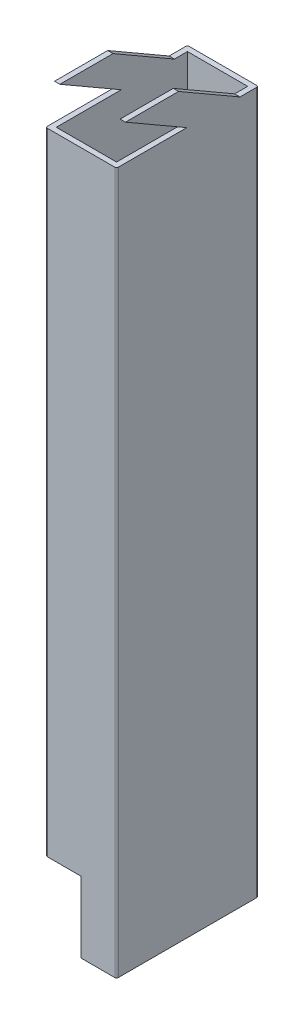
ISO-10303-21;
HEADER;
FILE_DESCRIPTION(('STEP AP214'),'2;1');
FILE_NAME('part.step','',(''),(''),'','','');
FILE_SCHEMA(('AUTOMOTIVE_DESIGN { 1 0 10303 214 1 1 1 1 }'));
ENDSEC;
DATA;
#1=APPLICATION_CONTEXT('core data for automotive mechanical design processes');
#2=APPLICATION_PROTOCOL_DEFINITION('international standard','automotive_design',2000,#1);
#3=PRODUCT_CONTEXT('',#1,'mechanical');
#4=PRODUCT('Part','Part','',(#3));
#5=PRODUCT_RELATED_PRODUCT_CATEGORY('part','',(#4));
#6=PRODUCT_DEFINITION_FORMATION('','',#4);
#7=PRODUCT_DEFINITION_CONTEXT('part definition',#1,'design');
#8=PRODUCT_DEFINITION('design','',#6,#7);
#9=PRODUCT_DEFINITION_SHAPE('','',#8);
#10=(LENGTH_UNIT() NAMED_UNIT(*) SI_UNIT(.MILLI.,.METRE.));
#11=(NAMED_UNIT(*) PLANE_ANGLE_UNIT() SI_UNIT($,.RADIAN.));
#12=(NAMED_UNIT(*) SI_UNIT($,.STERADIAN.) SOLID_ANGLE_UNIT());
#13=UNCERTAINTY_MEASURE_WITH_UNIT(LENGTH_MEASURE(1.E-05),#10,'distance_accuracy_value','');
#14=(GEOMETRIC_REPRESENTATION_CONTEXT(3) GLOBAL_UNCERTAINTY_ASSIGNED_CONTEXT((#13)) GLOBAL_UNIT_ASSIGNED_CONTEXT((#10,
#11,#12)) REPRESENTATION_CONTEXT('',''));
#15=CARTESIAN_POINT('',(0.,0.,0.));
#16=DIRECTION('',(0.,0.,1.));
#17=DIRECTION('',(1.,0.,0.));
#18=AXIS2_PLACEMENT_3D('',#15,#16,#17);
#19=CARTESIAN_POINT('',(19.5,208.,-0.5));
#20=DIRECTION('',(0.,1.,0.));
#21=DIRECTION('',(0.,0.,1.));
#22=AXIS2_PLACEMENT_3D('',#19,#20,#21);
#23=PLANE('',#22);
#24=DIRECTION('',(0.,0.,-1.));
#25=VECTOR('',#24,1.);
#26=CARTESIAN_POINT('',(20.,208.,-0.5));
#27=LINE('',#26,#25);
#28=CARTESIAN_POINT('',(20.,208.,-2.5));
#29=VERTEX_POINT('',#28);
#30=CARTESIAN_POINT('',(20.,208.,-17.5));
#31=VERTEX_POINT('',#30);
#32=EDGE_CURVE('E233',#29,#31,#27,.T.);
#33=ORIENTED_EDGE('',*,*,#32,.T.);
#34=DIRECTION('',(-1.,0.,0.));
#35=VECTOR('',#34,1.);
#36=CARTESIAN_POINT('',(40.,208.,-17.5));
#37=LINE('',#36,#35);
#38=CARTESIAN_POINT('',(18.5,208.,-17.5));
#39=VERTEX_POINT('',#38);
#40=EDGE_CURVE('E223',#31,#39,#37,.T.);
#41=ORIENTED_EDGE('',*,*,#40,.T.);
#42=DIRECTION('',(0.,0.,-1.));
#43=VECTOR('',#42,1.);
#44=CARTESIAN_POINT('',(18.5,208.,-1.5));
#45=LINE('',#44,#43);
#46=CARTESIAN_POINT('',(18.5,208.,-2.5));
#47=VERTEX_POINT('',#46);
#48=EDGE_CURVE('E395',#47,#39,#45,.T.);
#49=ORIENTED_EDGE('',*,*,#48,.F.);
#50=DIRECTION('',(-1.,0.,0.));
#51=VECTOR('',#50,1.);
#52=CARTESIAN_POINT('',(40.,208.,-2.5));
#53=LINE('',#52,#51);
#54=EDGE_CURVE('E55',#29,#47,#53,.T.);
#55=ORIENTED_EDGE('',*,*,#54,.F.);
#56=EDGE_LOOP('',(#33,#41,#49,#55));
#57=FACE_BOUND('',#56,.T.);
#58=ADVANCED_FACE('F39',(#57),#23,.T.);
#59=DIRECTION('',(0.,0.,1.));
#60=VECTOR('',#59,1.);
#61=CARTESIAN_POINT('',(1.5,208.,-1.5));
#62=LINE('',#61,#60);
#63=CARTESIAN_POINT('',(1.5,208.,-17.5));
#64=VERTEX_POINT('',#63);
#65=CARTESIAN_POINT('',(1.5,208.,-2.5));
#66=VERTEX_POINT('',#65);
#67=EDGE_CURVE('E221',#64,#66,#62,.T.);
#68=ORIENTED_EDGE('',*,*,#67,.F.);
#69=CARTESIAN_POINT('',(0.,208.,-17.5));
#70=VERTEX_POINT('',#69);
#71=EDGE_CURVE('E204',#64,#70,#37,.T.);
#72=ORIENTED_EDGE('',*,*,#71,.T.);
#73=DIRECTION('',(0.,0.,1.));
#74=VECTOR('',#73,1.);
#75=CARTESIAN_POINT('',(0.,208.,-0.500000000000004));
#76=LINE('',#75,#74);
#77=CARTESIAN_POINT('',(0.,208.,-2.5));
#78=VERTEX_POINT('',#77);
#79=EDGE_CURVE('E219',#70,#78,#76,.T.);
#80=ORIENTED_EDGE('',*,*,#79,.T.);
#81=EDGE_CURVE('E489',#66,#78,#53,.T.);
#82=ORIENTED_EDGE('',*,*,#81,.F.);
#83=EDGE_LOOP('',(#68,#72,#80,#82));
#84=FACE_BOUND('',#83,.T.);
#85=ADVANCED_FACE('F217',(#84),#23,.T.);
#86=CARTESIAN_POINT('',(19.5,208.,-0.5));
#87=DIRECTION('',(0.,-1.,0.));
#88=DIRECTION('',(0.,0.,-1.));
#89=AXIS2_PLACEMENT_3D('',#86,#87,#88);
#90=CYLINDRICAL_SURFACE('',#89,0.5);
#91=CARTESIAN_POINT('',(19.5,198.,-0.5));
#92=DIRECTION('',(0.,1.,0.));
#93=DIRECTION('',(0.,0.,1.));
#94=AXIS2_PLACEMENT_3D('',#91,#92,#93);
#95=CIRCLE('',#94,0.5);
#96=CARTESIAN_POINT('',(19.5,198.,0.));
#97=VERTEX_POINT('',#96);
#98=CARTESIAN_POINT('',(20.,198.,-0.5));
#99=VERTEX_POINT('',#98);
#100=EDGE_CURVE('E336',#97,#99,#95,.T.);
#101=ORIENTED_EDGE('',*,*,#100,.F.);
#102=DIRECTION('',(0.,-1.,0.));
#103=VECTOR('',#102,1.);
#104=CARTESIAN_POINT('',(19.5,208.,0.));
#105=LINE('',#104,#103);
#106=CARTESIAN_POINT('',(19.5,0.,0.));
#107=VERTEX_POINT('',#106);
#108=EDGE_CURVE('E232',#97,#107,#105,.T.);
#109=ORIENTED_EDGE('',*,*,#108,.T.);
#110=CARTESIAN_POINT('',(19.5,0.,-0.5));
#111=DIRECTION('',(0.,1.,0.));
#112=DIRECTION('',(0.,0.,1.));
#113=AXIS2_PLACEMENT_3D('',#110,#111,#112);
#114=CIRCLE('',#113,0.5);
#115=CARTESIAN_POINT('',(20.,0.,-0.5));
#116=VERTEX_POINT('',#115);
#117=EDGE_CURVE('E244',#107,#116,#114,.T.);
#118=ORIENTED_EDGE('',*,*,#117,.T.);
#119=DIRECTION('',(0.,-1.,0.));
#120=VECTOR('',#119,1.);
#121=CARTESIAN_POINT('',(20.,208.,-0.5));
#122=LINE('',#121,#120);
#123=EDGE_CURVE('E281',#99,#116,#122,.T.);
#124=ORIENTED_EDGE('',*,*,#123,.F.);
#125=EDGE_LOOP('',(#101,#109,#118,#124));
#126=FACE_BOUND('',#125,.T.);
#127=ADVANCED_FACE('F41',(#126),#90,.T.);
#128=CARTESIAN_POINT('',(20.,208.,-0.5));
#129=DIRECTION('',(-1.,0.,0.));
#130=DIRECTION('',(0.,0.,1.));
#131=AXIS2_PLACEMENT_3D('',#128,#129,#130);
#132=PLANE('',#131);
#133=DIRECTION('',(0.,-0.500000000000001,-0.866025403784438));
#134=VECTOR('',#133,1.);
#135=CARTESIAN_POINT('',(20.,215.361215932168,-4.75000000000001));
#136=LINE('',#135,#134);
#137=CARTESIAN_POINT('',(20.,198.,-34.8205080756887));
#138=VERTEX_POINT('',#137);
#139=EDGE_CURVE('E342',#31,#138,#136,.T.);
#140=ORIENTED_EDGE('',*,*,#139,.F.);
#141=ORIENTED_EDGE('',*,*,#32,.F.);
#142=DIRECTION('',(0.,0.500000000000002,0.866025403784438));
#143=VECTOR('',#142,1.);
#144=CARTESIAN_POINT('',(20.,208.866025403784,-1.));
#145=LINE('',#144,#143);
#146=CARTESIAN_POINT('',(20.,198.,-19.8205080756887));
#147=VERTEX_POINT('',#146);
#148=EDGE_CURVE('E321',#147,#29,#145,.T.);
#149=ORIENTED_EDGE('',*,*,#148,.F.);
#150=DIRECTION('',(0.,0.,-1.));
#151=VECTOR('',#150,1.);
#152=CARTESIAN_POINT('',(20.,198.,-0.5));
#153=LINE('',#152,#151);
#154=EDGE_CURVE('E333',#99,#147,#153,.T.);
#155=ORIENTED_EDGE('',*,*,#154,.F.);
#156=ORIENTED_EDGE('',*,*,#123,.T.);
#157=DIRECTION('',(0.,0.,-1.));
#158=VECTOR('',#157,1.);
#159=CARTESIAN_POINT('',(20.,0.,-0.5));
#160=LINE('',#159,#158);
#161=CARTESIAN_POINT('',(20.,0.,-39.5));
#162=VERTEX_POINT('',#161);
#163=EDGE_CURVE('E248',#116,#162,#160,.T.);
#164=ORIENTED_EDGE('',*,*,#163,.T.);
#165=DIRECTION('',(0.,-1.,0.));
#166=VECTOR('',#165,1.);
#167=CARTESIAN_POINT('',(20.,208.,-39.5));
#168=LINE('',#167,#166);
#169=CARTESIAN_POINT('',(20.,198.,-39.5));
#170=VERTEX_POINT('',#169);
#171=EDGE_CURVE('E278',#170,#162,#168,.T.);
#172=ORIENTED_EDGE('',*,*,#171,.F.);
#173=DIRECTION('',(0.,0.,-1.));
#174=VECTOR('',#173,1.);
#175=CARTESIAN_POINT('',(20.,198.,-0.5));
#176=LINE('',#175,#174);
#177=EDGE_CURVE('E483',#138,#170,#176,.T.);
#178=ORIENTED_EDGE('',*,*,#177,.F.);
#179=EDGE_LOOP('',(#140,#141,#149,#155,#156,#164,#172,#178));
#180=FACE_BOUND('',#179,.T.);
#181=ADVANCED_FACE('F522',(#180),#132,.F.);
#182=CARTESIAN_POINT('',(19.5,208.,-39.5));
#183=DIRECTION('',(0.,-1.,0.));
#184=DIRECTION('',(0.,0.,-1.));
#185=AXIS2_PLACEMENT_3D('',#182,#183,#184);
#186=CYLINDRICAL_SURFACE('',#185,0.5);
#187=CARTESIAN_POINT('',(19.5,198.,-39.5));
#188=DIRECTION('',(0.,1.,0.));
#189=DIRECTION('',(0.,0.,1.));
#190=AXIS2_PLACEMENT_3D('',#187,#188,#189);
#191=CIRCLE('',#190,0.5);
#192=CARTESIAN_POINT('',(19.5,198.,-40.));
#193=VERTEX_POINT('',#192);
#194=EDGE_CURVE('E475',#170,#193,#191,.T.);
#195=ORIENTED_EDGE('',*,*,#194,.F.);
#196=ORIENTED_EDGE('',*,*,#171,.T.);
#197=CARTESIAN_POINT('',(19.5,0.,-39.5));
#198=DIRECTION('',(0.,1.,0.));
#199=DIRECTION('',(0.,0.,-1.));
#200=AXIS2_PLACEMENT_3D('',#197,#198,#199);
#201=CIRCLE('',#200,0.5);
#202=CARTESIAN_POINT('',(19.5,0.,-40.));
#203=VERTEX_POINT('',#202);
#204=EDGE_CURVE('E253',#162,#203,#201,.T.);
#205=ORIENTED_EDGE('',*,*,#204,.T.);
#206=DIRECTION('',(0.,-1.,0.));
#207=VECTOR('',#206,1.);
#208=CARTESIAN_POINT('',(19.5,208.,-40.));
#209=LINE('',#208,#207);
#210=EDGE_CURVE('E275',#193,#203,#209,.T.);
#211=ORIENTED_EDGE('',*,*,#210,.F.);
#212=EDGE_LOOP('',(#195,#196,#205,#211));
#213=FACE_BOUND('',#212,.T.);
#214=ADVANCED_FACE('F529',(#213),#186,.T.);
#215=CARTESIAN_POINT('',(0.500000000000004,208.,-40.));
#216=DIRECTION('',(0.,0.,1.));
#217=DIRECTION('',(1.,0.,0.));
#218=AXIS2_PLACEMENT_3D('',#215,#216,#217);
#219=PLANE('',#218);
#220=DIRECTION('',(-1.,0.,0.));
#221=VECTOR('',#220,1.);
#222=CARTESIAN_POINT('',(40.,198.,-40.));
#223=LINE('',#222,#221);
#224=CARTESIAN_POINT('',(0.5,198.,-40.));
#225=VERTEX_POINT('',#224);
#226=EDGE_CURVE('E508',#193,#225,#223,.T.);
#227=ORIENTED_EDGE('',*,*,#226,.F.);
#228=ORIENTED_EDGE('',*,*,#210,.T.);
#229=DIRECTION('',(-1.,0.,0.));
#230=VECTOR('',#229,1.);
#231=CARTESIAN_POINT('',(0.500000000000004,0.,-40.));
#232=LINE('',#231,#230);
#233=CARTESIAN_POINT('',(10.,0.,-40.));
#234=VERTEX_POINT('',#233);
#235=EDGE_CURVE('E257',#203,#234,#232,.T.);
#236=ORIENTED_EDGE('',*,*,#235,.T.);
#237=DIRECTION('',(0.,1.,0.));
#238=VECTOR('',#237,1.);
#239=CARTESIAN_POINT('',(10.,0.,-40.));
#240=LINE('',#239,#238);
#241=CARTESIAN_POINT('',(10.,20.,-40.));
#242=VERTEX_POINT('',#241);
#243=EDGE_CURVE('E346',#234,#242,#240,.T.);
#244=ORIENTED_EDGE('',*,*,#243,.T.);
#245=DIRECTION('',(-1.,0.,0.));
#246=VECTOR('',#245,1.);
#247=CARTESIAN_POINT('',(10.,20.,-40.));
#248=LINE('',#247,#246);
#249=CARTESIAN_POINT('',(0.5,20.,-40.));
#250=VERTEX_POINT('',#249);
#251=EDGE_CURVE('E350',#242,#250,#248,.T.);
#252=ORIENTED_EDGE('',*,*,#251,.T.);
#253=DIRECTION('',(0.,-1.,0.));
#254=VECTOR('',#253,1.);
#255=CARTESIAN_POINT('',(0.5,208.,-40.));
#256=LINE('',#255,#254);
#257=EDGE_CURVE('E272',#225,#250,#256,.T.);
#258=ORIENTED_EDGE('',*,*,#257,.F.);
#259=EDGE_LOOP('',(#227,#228,#236,#244,#252,#258));
#260=FACE_BOUND('',#259,.T.);
#261=ADVANCED_FACE('F459',(#260),#219,.F.);
#262=CARTESIAN_POINT('',(0.5,208.,-39.5));
#263=DIRECTION('',(0.,-1.,0.));
#264=DIRECTION('',(0.,0.,-1.));
#265=AXIS2_PLACEMENT_3D('',#262,#263,#264);
#266=CYLINDRICAL_SURFACE('',#265,0.5);
#267=CARTESIAN_POINT('',(0.5,198.,-39.5));
#268=DIRECTION('',(0.,1.,0.));
#269=DIRECTION('',(0.,0.,1.));
#270=AXIS2_PLACEMENT_3D('',#267,#268,#269);
#271=CIRCLE('',#270,0.5);
#272=CARTESIAN_POINT('',(0.,198.,-39.5));
#273=VERTEX_POINT('',#272);
#274=EDGE_CURVE('E455',#225,#273,#271,.T.);
#275=ORIENTED_EDGE('',*,*,#274,.F.);
#276=ORIENTED_EDGE('',*,*,#257,.T.);
#277=CARTESIAN_POINT('',(0.5,20.,-39.5));
#278=DIRECTION('',(0.,1.,0.));
#279=DIRECTION('',(-1.,0.,0.));
#280=AXIS2_PLACEMENT_3D('',#277,#278,#279);
#281=CIRCLE('',#280,0.5);
#282=CARTESIAN_POINT('',(0.,20.,-39.5));
#283=VERTEX_POINT('',#282);
#284=EDGE_CURVE('E388',#250,#283,#281,.T.);
#285=ORIENTED_EDGE('',*,*,#284,.T.);
#286=DIRECTION('',(0.,-1.,0.));
#287=VECTOR('',#286,1.);
#288=CARTESIAN_POINT('',(0.,208.,-39.5));
#289=LINE('',#288,#287);
#290=EDGE_CURVE('E269',#273,#283,#289,.T.);
#291=ORIENTED_EDGE('',*,*,#290,.F.);
#292=EDGE_LOOP('',(#275,#276,#285,#291));
#293=FACE_BOUND('',#292,.T.);
#294=ADVANCED_FACE('F454',(#293),#266,.T.);
#295=CARTESIAN_POINT('',(0.,208.,-0.500000000000004));
#296=DIRECTION('',(1.,0.,0.));
#297=DIRECTION('',(0.,0.,-1.));
#298=AXIS2_PLACEMENT_3D('',#295,#296,#297);
#299=PLANE('',#298);
#300=DIRECTION('',(0.,-0.500000000000001,-0.866025403784438));
#301=VECTOR('',#300,1.);
#302=CARTESIAN_POINT('',(0.,208.,-17.5));
#303=LINE('',#302,#301);
#304=CARTESIAN_POINT('',(0.,198.,-34.8205080756887));
#305=VERTEX_POINT('',#304);
#306=EDGE_CURVE('E201',#70,#305,#303,.T.);
#307=ORIENTED_EDGE('',*,*,#306,.T.);
#308=DIRECTION('',(0.,0.,-1.));
#309=VECTOR('',#308,1.);
#310=CARTESIAN_POINT('',(0.,198.,-34.8205080756887));
#311=LINE('',#310,#309);
#312=EDGE_CURVE('E212',#305,#273,#311,.T.);
#313=ORIENTED_EDGE('',*,*,#312,.T.);
#314=ORIENTED_EDGE('',*,*,#290,.T.);
#315=DIRECTION('',(0.,0.,1.));
#316=VECTOR('',#315,1.);
#317=CARTESIAN_POINT('',(0.,20.,-40.));
#318=LINE('',#317,#316);
#319=CARTESIAN_POINT('',(0.,20.,-0.5));
#320=VERTEX_POINT('',#319);
#321=EDGE_CURVE('E362',#283,#320,#318,.T.);
#322=ORIENTED_EDGE('',*,*,#321,.T.);
#323=DIRECTION('',(0.,-1.,0.));
#324=VECTOR('',#323,1.);
#325=CARTESIAN_POINT('',(0.,208.,-0.500000000000003));
#326=LINE('',#325,#324);
#327=CARTESIAN_POINT('',(0.,198.,-0.5));
#328=VERTEX_POINT('',#327);
#329=EDGE_CURVE('E266',#328,#320,#326,.T.);
#330=ORIENTED_EDGE('',*,*,#329,.F.);
#331=DIRECTION('',(0.,0.,-1.));
#332=VECTOR('',#331,1.);
#333=CARTESIAN_POINT('',(0.,198.,0.));
#334=LINE('',#333,#332);
#335=CARTESIAN_POINT('',(0.,198.,-19.8205080756887));
#336=VERTEX_POINT('',#335);
#337=EDGE_CURVE('E495',#328,#336,#334,.T.);
#338=ORIENTED_EDGE('',*,*,#337,.T.);
#339=DIRECTION('',(0.,0.500000000000002,0.866025403784438));
#340=VECTOR('',#339,1.);
#341=CARTESIAN_POINT('',(0.,198.,-19.8205080756887));
#342=LINE('',#341,#340);
#343=EDGE_CURVE('E230',#336,#78,#342,.T.);
#344=ORIENTED_EDGE('',*,*,#343,.T.);
#345=ORIENTED_EDGE('',*,*,#79,.F.);
#346=EDGE_LOOP('',(#307,#313,#314,#322,#330,#338,#344,#345));
#347=FACE_BOUND('',#346,.T.);
#348=ADVANCED_FACE('F227',(#347),#299,.F.);
#349=CARTESIAN_POINT('',(0.5,208.,-0.5));
#350=DIRECTION('',(0.,-1.,0.));
#351=DIRECTION('',(0.,0.,-1.));
#352=AXIS2_PLACEMENT_3D('',#349,#350,#351);
#353=CYLINDRICAL_SURFACE('',#352,0.5);
#354=CARTESIAN_POINT('',(0.5,198.,-0.5));
#355=DIRECTION('',(0.,1.,0.));
#356=DIRECTION('',(0.,0.,1.));
#357=AXIS2_PLACEMENT_3D('',#354,#355,#356);
#358=CIRCLE('',#357,0.5);
#359=CARTESIAN_POINT('',(0.5,198.,0.));
#360=VERTEX_POINT('',#359);
#361=EDGE_CURVE('E325',#328,#360,#358,.T.);
#362=ORIENTED_EDGE('',*,*,#361,.F.);
#363=ORIENTED_EDGE('',*,*,#329,.T.);
#364=CARTESIAN_POINT('',(0.5,20.,-0.5));
#365=DIRECTION('',(0.,1.,0.));
#366=DIRECTION('',(-1.,0.,0.));
#367=AXIS2_PLACEMENT_3D('',#364,#365,#366);
#368=CIRCLE('',#367,0.5);
#369=CARTESIAN_POINT('',(0.500000000000004,20.,0.));
#370=VERTEX_POINT('',#369);
#371=EDGE_CURVE('E384',#320,#370,#368,.T.);
#372=ORIENTED_EDGE('',*,*,#371,.T.);
#373=DIRECTION('',(0.,-1.,0.));
#374=VECTOR('',#373,1.);
#375=CARTESIAN_POINT('',(0.500000000000004,208.,0.));
#376=LINE('',#375,#374);
#377=EDGE_CURVE('E237',#360,#370,#376,.T.);
#378=ORIENTED_EDGE('',*,*,#377,.F.);
#379=EDGE_LOOP('',(#362,#363,#372,#378));
#380=FACE_BOUND('',#379,.T.);
#381=ADVANCED_FACE('F447',(#380),#353,.T.);
#382=CARTESIAN_POINT('',(0.500000000000004,208.,0.));
#383=DIRECTION('',(0.,0.,-1.));
#384=DIRECTION('',(-1.,0.,0.));
#385=AXIS2_PLACEMENT_3D('',#382,#383,#384);
#386=PLANE('',#385);
#387=DIRECTION('',(-1.,0.,0.));
#388=VECTOR('',#387,1.);
#389=CARTESIAN_POINT('',(40.,198.,0.));
#390=LINE('',#389,#388);
#391=EDGE_CURVE('E444',#97,#360,#390,.T.);
#392=ORIENTED_EDGE('',*,*,#391,.T.);
#393=ORIENTED_EDGE('',*,*,#377,.T.);
#394=DIRECTION('',(-1.,0.,0.));
#395=VECTOR('',#394,1.);
#396=CARTESIAN_POINT('',(10.,20.,0.));
#397=LINE('',#396,#395);
#398=CARTESIAN_POINT('',(10.,20.,0.));
#399=VERTEX_POINT('',#398);
#400=EDGE_CURVE('E351',#399,#370,#397,.T.);
#401=ORIENTED_EDGE('',*,*,#400,.F.);
#402=DIRECTION('',(0.,1.,0.));
#403=VECTOR('',#402,1.);
#404=CARTESIAN_POINT('',(10.,0.,0.));
#405=LINE('',#404,#403);
#406=CARTESIAN_POINT('',(10.,0.,0.));
#407=VERTEX_POINT('',#406);
#408=EDGE_CURVE('E345',#407,#399,#405,.T.);
#409=ORIENTED_EDGE('',*,*,#408,.F.);
#410=DIRECTION('',(1.,0.,0.));
#411=VECTOR('',#410,1.);
#412=CARTESIAN_POINT('',(0.500000000000004,0.,0.));
#413=LINE('',#412,#411);
#414=EDGE_CURVE('E240',#407,#107,#413,.T.);
#415=ORIENTED_EDGE('',*,*,#414,.T.);
#416=ORIENTED_EDGE('',*,*,#108,.F.);
#417=EDGE_LOOP('',(#392,#393,#401,#409,#415,#416));
#418=FACE_BOUND('',#417,.T.);
#419=ADVANCED_FACE('F441',(#418),#386,.F.);
#420=CARTESIAN_POINT('',(1.5,208.,-1.5));
#421=DIRECTION('',(1.,0.,0.));
#422=DIRECTION('',(0.,0.,-1.));
#423=AXIS2_PLACEMENT_3D('',#420,#421,#422);
#424=PLANE('',#423);
#425=DIRECTION('',(0.,0.,1.));
#426=VECTOR('',#425,1.);
#427=CARTESIAN_POINT('',(1.5,198.,-1.5));
#428=LINE('',#427,#426);
#429=CARTESIAN_POINT('',(1.5,198.,-38.5));
#430=VERTEX_POINT('',#429);
#431=CARTESIAN_POINT('',(1.5,198.,-34.8205080756887));
#432=VERTEX_POINT('',#431);
#433=EDGE_CURVE('E63',#430,#432,#428,.T.);
#434=ORIENTED_EDGE('',*,*,#433,.T.);
#435=DIRECTION('',(0.,0.500000000000001,0.866025403784438));
#436=VECTOR('',#435,1.);
#437=CARTESIAN_POINT('',(1.5,214.928203230275,-5.50000000000001));
#438=LINE('',#437,#436);
#439=EDGE_CURVE('E339',#432,#64,#438,.T.);
#440=ORIENTED_EDGE('',*,*,#439,.T.);
#441=ORIENTED_EDGE('',*,*,#67,.T.);
#442=DIRECTION('',(0.,-0.500000000000002,-0.866025403784438));
#443=VECTOR('',#442,1.);
#444=CARTESIAN_POINT('',(1.5,208.433012701892,-1.75));
#445=LINE('',#444,#443);
#446=CARTESIAN_POINT('',(1.5,198.,-19.8205080756887));
#447=VERTEX_POINT('',#446);
#448=EDGE_CURVE('E327',#66,#447,#445,.T.);
#449=ORIENTED_EDGE('',*,*,#448,.T.);
#450=DIRECTION('',(0.,0.,1.));
#451=VECTOR('',#450,1.);
#452=CARTESIAN_POINT('',(1.5,198.,-1.5));
#453=LINE('',#452,#451);
#454=CARTESIAN_POINT('',(1.5,198.,-1.5));
#455=VERTEX_POINT('',#454);
#456=EDGE_CURVE('E320',#447,#455,#453,.T.);
#457=ORIENTED_EDGE('',*,*,#456,.T.);
#458=DIRECTION('',(0.,-1.,0.));
#459=VECTOR('',#458,1.);
#460=CARTESIAN_POINT('',(1.5,208.,-1.5));
#461=LINE('',#460,#459);
#462=CARTESIAN_POINT('',(1.5,20.,-1.5));
#463=VERTEX_POINT('',#462);
#464=EDGE_CURVE('E249',#455,#463,#461,.T.);
#465=ORIENTED_EDGE('',*,*,#464,.T.);
#466=DIRECTION('',(0.,0.,1.));
#467=VECTOR('',#466,1.);
#468=CARTESIAN_POINT('',(1.5,20.,-1.5));
#469=LINE('',#468,#467);
#470=CARTESIAN_POINT('',(1.5,20.,-38.5));
#471=VERTEX_POINT('',#470);
#472=EDGE_CURVE('E377',#471,#463,#469,.T.);
#473=ORIENTED_EDGE('',*,*,#472,.F.);
#474=DIRECTION('',(0.,-1.,0.));
#475=VECTOR('',#474,1.);
#476=CARTESIAN_POINT('',(1.5,208.,-38.5));
#477=LINE('',#476,#475);
#478=EDGE_CURVE('E399',#430,#471,#477,.T.);
#479=ORIENTED_EDGE('',*,*,#478,.F.);
#480=EDGE_LOOP('',(#434,#440,#441,#449,#457,#465,#473,#479));
#481=FACE_BOUND('',#480,.T.);
#482=ADVANCED_FACE('F418',(#481),#424,.T.);
#483=CARTESIAN_POINT('',(1.5,208.,-1.5));
#484=DIRECTION('',(0.,0.,-1.));
#485=DIRECTION('',(-1.,0.,0.));
#486=AXIS2_PLACEMENT_3D('',#483,#484,#485);
#487=PLANE('',#486);
#488=ORIENTED_EDGE('',*,*,#464,.F.);
#489=DIRECTION('',(1.,0.,0.));
#490=VECTOR('',#489,1.);
#491=CARTESIAN_POINT('',(1.5,198.,-1.5));
#492=LINE('',#491,#490);
#493=CARTESIAN_POINT('',(18.5,198.,-1.5));
#494=VERTEX_POINT('',#493);
#495=EDGE_CURVE('E309',#455,#494,#492,.T.);
#496=ORIENTED_EDGE('',*,*,#495,.T.);
#497=DIRECTION('',(0.,-1.,0.));
#498=VECTOR('',#497,1.);
#499=CARTESIAN_POINT('',(18.5,208.,-1.5));
#500=LINE('',#499,#498);
#501=CARTESIAN_POINT('',(18.5,0.,-1.5));
#502=VERTEX_POINT('',#501);
#503=EDGE_CURVE('E304',#494,#502,#500,.T.);
#504=ORIENTED_EDGE('',*,*,#503,.T.);
#505=DIRECTION('',(1.,0.,0.));
#506=VECTOR('',#505,1.);
#507=CARTESIAN_POINT('',(1.5,0.,-1.5));
#508=LINE('',#507,#506);
#509=CARTESIAN_POINT('',(10.,0.,-1.5));
#510=VERTEX_POINT('',#509);
#511=EDGE_CURVE('E392',#510,#502,#508,.T.);
#512=ORIENTED_EDGE('',*,*,#511,.F.);
#513=DIRECTION('',(0.,-1.,0.));
#514=VECTOR('',#513,1.);
#515=CARTESIAN_POINT('',(10.,208.,-1.5));
#516=LINE('',#515,#514);
#517=CARTESIAN_POINT('',(10.,20.,-1.5));
#518=VERTEX_POINT('',#517);
#519=EDGE_CURVE('E366',#518,#510,#516,.T.);
#520=ORIENTED_EDGE('',*,*,#519,.F.);
#521=DIRECTION('',(1.,0.,0.));
#522=VECTOR('',#521,1.);
#523=CARTESIAN_POINT('',(1.5000000000002,20.,-1.5));
#524=LINE('',#523,#522);
#525=EDGE_CURVE('E381',#463,#518,#524,.T.);
#526=ORIENTED_EDGE('',*,*,#525,.F.);
#527=EDGE_LOOP('',(#488,#496,#504,#512,#520,#526));
#528=FACE_BOUND('',#527,.T.);
#529=ADVANCED_FACE('F315',(#528),#487,.T.);
#530=CARTESIAN_POINT('',(18.5,208.,-1.5));
#531=DIRECTION('',(-1.,0.,0.));
#532=DIRECTION('',(0.,0.,1.));
#533=AXIS2_PLACEMENT_3D('',#530,#531,#532);
#534=PLANE('',#533);
#535=ORIENTED_EDGE('',*,*,#48,.T.);
#536=DIRECTION('',(0.,-0.500000000000001,-0.866025403784438));
#537=VECTOR('',#536,1.);
#538=CARTESIAN_POINT('',(18.5,214.928203230275,-5.50000000000001));
#539=LINE('',#538,#537);
#540=CARTESIAN_POINT('',(18.5,198.,-34.8205080756887));
#541=VERTEX_POINT('',#540);
#542=EDGE_CURVE('E11',#39,#541,#539,.T.);
#543=ORIENTED_EDGE('',*,*,#542,.T.);
#544=DIRECTION('',(0.,0.,-1.));
#545=VECTOR('',#544,1.);
#546=CARTESIAN_POINT('',(18.5,198.,-1.5));
#547=LINE('',#546,#545);
#548=CARTESIAN_POINT('',(18.5,198.,-38.5));
#549=VERTEX_POINT('',#548);
#550=EDGE_CURVE('E471',#541,#549,#547,.T.);
#551=ORIENTED_EDGE('',*,*,#550,.T.);
#552=DIRECTION('',(0.,-1.,0.));
#553=VECTOR('',#552,1.);
#554=CARTESIAN_POINT('',(18.5,208.,-38.5));
#555=LINE('',#554,#553);
#556=CARTESIAN_POINT('',(18.5,0.,-38.5));
#557=VERTEX_POINT('',#556);
#558=EDGE_CURVE('E411',#549,#557,#555,.T.);
#559=ORIENTED_EDGE('',*,*,#558,.T.);
#560=DIRECTION('',(0.,0.,-1.));
#561=VECTOR('',#560,1.);
#562=CARTESIAN_POINT('',(18.5,0.,-1.5));
#563=LINE('',#562,#561);
#564=EDGE_CURVE('E402',#502,#557,#563,.T.);
#565=ORIENTED_EDGE('',*,*,#564,.F.);
#566=ORIENTED_EDGE('',*,*,#503,.F.);
#567=DIRECTION('',(0.,0.,-1.));
#568=VECTOR('',#567,1.);
#569=CARTESIAN_POINT('',(18.5,198.,-1.5));
#570=LINE('',#569,#568);
#571=CARTESIAN_POINT('',(18.5,198.,-19.8205080756887));
#572=VERTEX_POINT('',#571);
#573=EDGE_CURVE('E48',#494,#572,#570,.T.);
#574=ORIENTED_EDGE('',*,*,#573,.T.);
#575=DIRECTION('',(0.,0.500000000000002,0.866025403784438));
#576=VECTOR('',#575,1.);
#577=CARTESIAN_POINT('',(18.5,208.433012701892,-1.75));
#578=LINE('',#577,#576);
#579=EDGE_CURVE('E294',#572,#47,#578,.T.);
#580=ORIENTED_EDGE('',*,*,#579,.T.);
#581=EDGE_LOOP('',(#535,#543,#551,#559,#565,#566,#574,#580));
#582=FACE_BOUND('',#581,.T.);
#583=ADVANCED_FACE('F301',(#582),#534,.T.);
#584=CARTESIAN_POINT('',(1.5,208.,-38.5));
#585=DIRECTION('',(0.,0.,1.));
#586=DIRECTION('',(1.,0.,0.));
#587=AXIS2_PLACEMENT_3D('',#584,#585,#586);
#588=PLANE('',#587);
#589=ORIENTED_EDGE('',*,*,#558,.F.);
#590=DIRECTION('',(-1.,0.,0.));
#591=VECTOR('',#590,1.);
#592=CARTESIAN_POINT('',(1.5,198.,-38.5));
#593=LINE('',#592,#591);
#594=EDGE_CURVE('E291',#549,#430,#593,.T.);
#595=ORIENTED_EDGE('',*,*,#594,.T.);
#596=ORIENTED_EDGE('',*,*,#478,.T.);
#597=DIRECTION('',(-1.,0.,0.));
#598=VECTOR('',#597,1.);
#599=CARTESIAN_POINT('',(1.5000000000002,20.,-38.5));
#600=LINE('',#599,#598);
#601=CARTESIAN_POINT('',(10.,20.,-38.5));
#602=VERTEX_POINT('',#601);
#603=EDGE_CURVE('E287',#602,#471,#600,.T.);
#604=ORIENTED_EDGE('',*,*,#603,.F.);
#605=DIRECTION('',(0.,1.,0.));
#606=VECTOR('',#605,1.);
#607=CARTESIAN_POINT('',(10.,208.,-38.5));
#608=LINE('',#607,#606);
#609=CARTESIAN_POINT('',(10.,0.,-38.5));
#610=VERTEX_POINT('',#609);
#611=EDGE_CURVE('E284',#610,#602,#608,.T.);
#612=ORIENTED_EDGE('',*,*,#611,.F.);
#613=DIRECTION('',(-1.,0.,0.));
#614=VECTOR('',#613,1.);
#615=CARTESIAN_POINT('',(1.5,0.,-38.5));
#616=LINE('',#615,#614);
#617=EDGE_CURVE('E396',#557,#610,#616,.T.);
#618=ORIENTED_EDGE('',*,*,#617,.F.);
#619=EDGE_LOOP('',(#589,#595,#596,#604,#612,#618));
#620=FACE_BOUND('',#619,.T.);
#621=ADVANCED_FACE('F469',(#620),#588,.T.);
#622=CARTESIAN_POINT('',(19.5,0.,-0.5));
#623=DIRECTION('',(0.,1.,0.));
#624=DIRECTION('',(0.,0.,1.));
#625=AXIS2_PLACEMENT_3D('',#622,#623,#624);
#626=PLANE('',#625);
#627=ORIENTED_EDGE('',*,*,#414,.F.);
#628=DIRECTION('',(0.,0.,1.));
#629=VECTOR('',#628,1.);
#630=CARTESIAN_POINT('',(10.,0.,-40.));
#631=LINE('',#630,#629);
#632=EDGE_CURVE('E355',#510,#407,#631,.T.);
#633=ORIENTED_EDGE('',*,*,#632,.F.);
#634=ORIENTED_EDGE('',*,*,#511,.T.);
#635=ORIENTED_EDGE('',*,*,#564,.T.);
#636=ORIENTED_EDGE('',*,*,#617,.T.);
#637=EDGE_CURVE('E372',#234,#610,#631,.T.);
#638=ORIENTED_EDGE('',*,*,#637,.F.);
#639=ORIENTED_EDGE('',*,*,#235,.F.);
#640=ORIENTED_EDGE('',*,*,#204,.F.);
#641=ORIENTED_EDGE('',*,*,#163,.F.);
#642=ORIENTED_EDGE('',*,*,#117,.F.);
#643=EDGE_LOOP('',(#627,#633,#634,#635,#636,#638,#639,#640,#641,#642));
#644=FACE_BOUND('',#643,.T.);
#645=ADVANCED_FACE('F433',(#644),#626,.F.);
#646=CARTESIAN_POINT('',(10.,20.,-40.));
#647=DIRECTION('',(0.,1.,0.));
#648=DIRECTION('',(-1.,0.,0.));
#649=AXIS2_PLACEMENT_3D('',#646,#647,#648);
#650=PLANE('',#649);
#651=ORIENTED_EDGE('',*,*,#251,.F.);
#652=DIRECTION('',(0.,0.,1.));
#653=VECTOR('',#652,1.);
#654=CARTESIAN_POINT('',(10.,20.,-40.));
#655=LINE('',#654,#653);
#656=EDGE_CURVE('E367',#242,#602,#655,.T.);
#657=ORIENTED_EDGE('',*,*,#656,.T.);
#658=ORIENTED_EDGE('',*,*,#603,.T.);
#659=ORIENTED_EDGE('',*,*,#472,.T.);
#660=ORIENTED_EDGE('',*,*,#525,.T.);
#661=EDGE_CURVE('E371',#518,#399,#655,.T.);
#662=ORIENTED_EDGE('',*,*,#661,.T.);
#663=ORIENTED_EDGE('',*,*,#400,.T.);
#664=ORIENTED_EDGE('',*,*,#371,.F.);
#665=ORIENTED_EDGE('',*,*,#321,.F.);
#666=ORIENTED_EDGE('',*,*,#284,.F.);
#667=EDGE_LOOP('',(#651,#657,#658,#659,#660,#662,#663,#664,#665,#666));
#668=FACE_BOUND('',#667,.T.);
#669=ADVANCED_FACE('F423',(#668),#650,.F.);
#670=CARTESIAN_POINT('',(10.,0.,-40.));
#671=DIRECTION('',(1.,0.,0.));
#672=DIRECTION('',(0.,0.,-1.));
#673=AXIS2_PLACEMENT_3D('',#670,#671,#672);
#674=PLANE('',#673);
#675=ORIENTED_EDGE('',*,*,#519,.T.);
#676=ORIENTED_EDGE('',*,*,#632,.T.);
#677=ORIENTED_EDGE('',*,*,#408,.T.);
#678=ORIENTED_EDGE('',*,*,#661,.F.);
#679=EDGE_LOOP('',(#675,#676,#677,#678));
#680=FACE_BOUND('',#679,.T.);
#681=ADVANCED_FACE('F429',(#680),#674,.F.);
#682=ORIENTED_EDGE('',*,*,#611,.T.);
#683=ORIENTED_EDGE('',*,*,#656,.F.);
#684=ORIENTED_EDGE('',*,*,#243,.F.);
#685=ORIENTED_EDGE('',*,*,#637,.T.);
#686=EDGE_LOOP('',(#682,#683,#684,#685));
#687=FACE_BOUND('',#686,.T.);
#688=ADVANCED_FACE('F463',(#687),#674,.F.);
#689=CARTESIAN_POINT('',(40.,208.,-17.5));
#690=DIRECTION('',(0.,0.866025403784438,-0.500000000000001));
#691=DIRECTION('',(0.,0.500000000000001,0.866025403784438));
#692=AXIS2_PLACEMENT_3D('',#689,#690,#691);
#693=PLANE('',#692);
#694=ORIENTED_EDGE('',*,*,#139,.T.);
#695=DIRECTION('',(-1.,0.,0.));
#696=VECTOR('',#695,1.);
#697=CARTESIAN_POINT('',(40.,198.,-34.8205080756887));
#698=LINE('',#697,#696);
#699=EDGE_CURVE('E224',#138,#541,#698,.T.);
#700=ORIENTED_EDGE('',*,*,#699,.T.);
#701=ORIENTED_EDGE('',*,*,#542,.F.);
#702=ORIENTED_EDGE('',*,*,#40,.F.);
#703=EDGE_LOOP('',(#694,#700,#701,#702));
#704=FACE_BOUND('',#703,.T.);
#705=ADVANCED_FACE('F516',(#704),#693,.T.);
#706=EDGE_CURVE('E206',#432,#305,#698,.T.);
#707=ORIENTED_EDGE('',*,*,#706,.T.);
#708=ORIENTED_EDGE('',*,*,#306,.F.);
#709=ORIENTED_EDGE('',*,*,#71,.F.);
#710=ORIENTED_EDGE('',*,*,#439,.F.);
#711=EDGE_LOOP('',(#707,#708,#709,#710));
#712=FACE_BOUND('',#711,.T.);
#713=ADVANCED_FACE('F203',(#712),#693,.T.);
#714=CARTESIAN_POINT('',(40.,198.,-34.8205080756887));
#715=DIRECTION('',(0.,1.,0.));
#716=DIRECTION('',(0.,0.,1.));
#717=AXIS2_PLACEMENT_3D('',#714,#715,#716);
#718=PLANE('',#717);
#719=ORIENTED_EDGE('',*,*,#177,.T.);
#720=ORIENTED_EDGE('',*,*,#194,.T.);
#721=ORIENTED_EDGE('',*,*,#226,.T.);
#722=ORIENTED_EDGE('',*,*,#274,.T.);
#723=ORIENTED_EDGE('',*,*,#312,.F.);
#724=ORIENTED_EDGE('',*,*,#706,.F.);
#725=ORIENTED_EDGE('',*,*,#433,.F.);
#726=ORIENTED_EDGE('',*,*,#594,.F.);
#727=ORIENTED_EDGE('',*,*,#550,.F.);
#728=ORIENTED_EDGE('',*,*,#699,.F.);
#729=EDGE_LOOP('',(#719,#720,#721,#722,#723,#724,#725,#726,#727,#728));
#730=FACE_BOUND('',#729,.T.);
#731=ADVANCED_FACE('F526',(#730),#718,.T.);
#732=CARTESIAN_POINT('',(40.,198.,0.));
#733=DIRECTION('',(0.,1.,0.));
#734=DIRECTION('',(0.,0.,1.));
#735=AXIS2_PLACEMENT_3D('',#732,#733,#734);
#736=PLANE('',#735);
#737=ORIENTED_EDGE('',*,*,#100,.T.);
#738=ORIENTED_EDGE('',*,*,#154,.T.);
#739=DIRECTION('',(-1.,0.,0.));
#740=VECTOR('',#739,1.);
#741=CARTESIAN_POINT('',(40.,198.,-19.8205080756887));
#742=LINE('',#741,#740);
#743=EDGE_CURVE('E312',#147,#572,#742,.T.);
#744=ORIENTED_EDGE('',*,*,#743,.T.);
#745=ORIENTED_EDGE('',*,*,#573,.F.);
#746=ORIENTED_EDGE('',*,*,#495,.F.);
#747=ORIENTED_EDGE('',*,*,#456,.F.);
#748=EDGE_CURVE('E490',#447,#336,#742,.T.);
#749=ORIENTED_EDGE('',*,*,#748,.T.);
#750=ORIENTED_EDGE('',*,*,#337,.F.);
#751=ORIENTED_EDGE('',*,*,#361,.T.);
#752=ORIENTED_EDGE('',*,*,#391,.F.);
#753=EDGE_LOOP('',(#737,#738,#744,#745,#746,#747,#749,#750,#751,#752));
#754=FACE_BOUND('',#753,.T.);
#755=ADVANCED_FACE('F308',(#754),#736,.T.);
#756=CARTESIAN_POINT('',(40.,198.,-19.8205080756887));
#757=DIRECTION('',(0.,-0.866025403784438,0.500000000000002));
#758=DIRECTION('',(0.,-0.500000000000002,-0.866025403784438));
#759=AXIS2_PLACEMENT_3D('',#756,#757,#758);
#760=PLANE('',#759);
#761=ORIENTED_EDGE('',*,*,#148,.T.);
#762=ORIENTED_EDGE('',*,*,#54,.T.);
#763=ORIENTED_EDGE('',*,*,#579,.F.);
#764=ORIENTED_EDGE('',*,*,#743,.F.);
#765=EDGE_LOOP('',(#761,#762,#763,#764));
#766=FACE_BOUND('',#765,.T.);
#767=ADVANCED_FACE('F535',(#766),#760,.T.);
#768=ORIENTED_EDGE('',*,*,#81,.T.);
#769=ORIENTED_EDGE('',*,*,#343,.F.);
#770=ORIENTED_EDGE('',*,*,#748,.F.);
#771=ORIENTED_EDGE('',*,*,#448,.F.);
#772=EDGE_LOOP('',(#768,#769,#770,#771));
#773=FACE_BOUND('',#772,.T.);
#774=ADVANCED_FACE('F488',(#773),#760,.T.);
#775=CLOSED_SHELL('',(#58,#85,#127,#181,#214,#261,#294,#348,#381,#419,#482,#529,#583,#621,#645,
#669,#681,#688,#705,#713,#731,#755,#767,#774));
#776=MANIFOLD_SOLID_BREP('B2',#775);
#777=ADVANCED_BREP_SHAPE_REPRESENTATION('',(#18,#776),#14);
#778=SHAPE_DEFINITION_REPRESENTATION(#9,#777);
ENDSEC;
END-ISO-10303-21;
